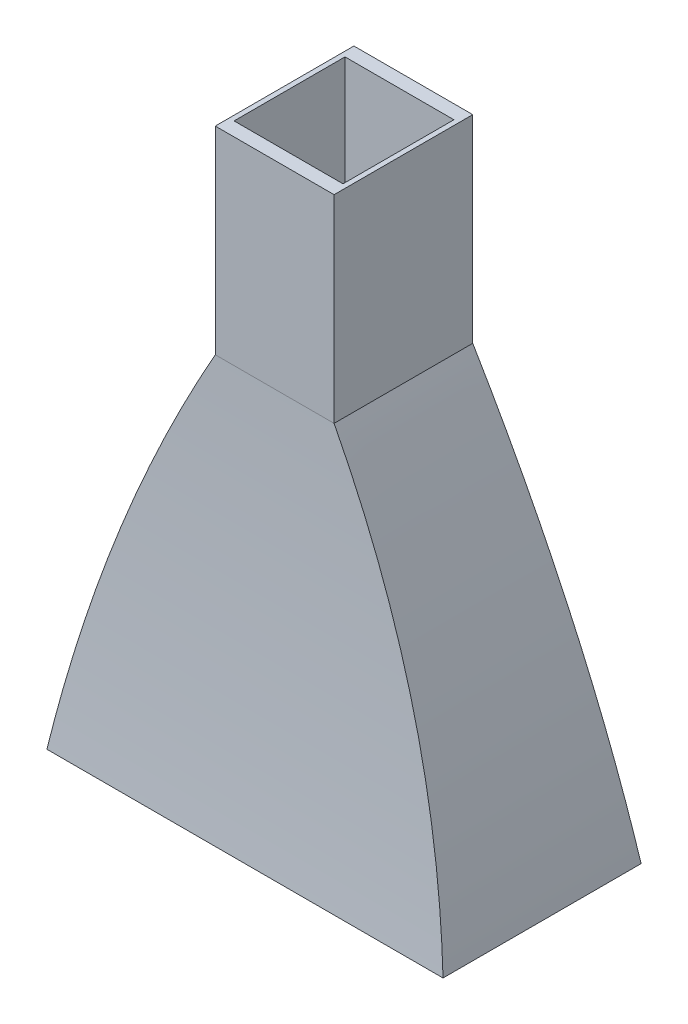
ISO-10303-21;
HEADER;
FILE_DESCRIPTION(('STEP AP214'),'2;1');
FILE_NAME('part.step','',(''),(''),'','','');
FILE_SCHEMA(('AUTOMOTIVE_DESIGN { 1 0 10303 214 1 1 1 1 }'));
ENDSEC;
DATA;
#1=APPLICATION_CONTEXT('core data for automotive mechanical design processes');
#2=APPLICATION_PROTOCOL_DEFINITION('international standard','automotive_design',2000,#1);
#3=PRODUCT_CONTEXT('',#1,'mechanical');
#4=PRODUCT('Part','Part','',(#3));
#5=PRODUCT_RELATED_PRODUCT_CATEGORY('part','',(#4));
#6=PRODUCT_DEFINITION_FORMATION('','',#4);
#7=PRODUCT_DEFINITION_CONTEXT('part definition',#1,'design');
#8=PRODUCT_DEFINITION('design','',#6,#7);
#9=PRODUCT_DEFINITION_SHAPE('','',#8);
#10=(LENGTH_UNIT() NAMED_UNIT(*) SI_UNIT(.MILLI.,.METRE.));
#11=(NAMED_UNIT(*) PLANE_ANGLE_UNIT() SI_UNIT($,.RADIAN.));
#12=(NAMED_UNIT(*) SI_UNIT($,.STERADIAN.) SOLID_ANGLE_UNIT());
#13=UNCERTAINTY_MEASURE_WITH_UNIT(LENGTH_MEASURE(1.E-05),#10,'distance_accuracy_value','');
#14=(GEOMETRIC_REPRESENTATION_CONTEXT(3) GLOBAL_UNCERTAINTY_ASSIGNED_CONTEXT((#13)) GLOBAL_UNIT_ASSIGNED_CONTEXT((#10,
#11,#12)) REPRESENTATION_CONTEXT('',''));
#15=CARTESIAN_POINT('',(0.,0.,0.));
#16=DIRECTION('',(0.,0.,1.));
#17=DIRECTION('',(1.,0.,0.));
#18=AXIS2_PLACEMENT_3D('',#15,#16,#17);
#19=CARTESIAN_POINT('',(0.,0.,0.));
#20=DIRECTION('',(0.,1.,0.));
#21=DIRECTION('',(0.,0.,1.));
#22=AXIS2_PLACEMENT_3D('',#19,#20,#21);
#23=PLANE('',#22);
#24=DIRECTION('',(-1.,0.,0.));
#25=VECTOR('',#24,1.);
#26=CARTESIAN_POINT('',(-93.6444715864191,0.,-44.4638523278584));
#27=LINE('',#26,#25);
#28=CARTESIAN_POINT('',(93.6444715864191,0.,-44.4638523278584));
#29=VERTEX_POINT('',#28);
#30=CARTESIAN_POINT('',(-93.6444715864191,0.,-44.4638523278584));
#31=VERTEX_POINT('',#30);
#32=EDGE_CURVE('E360',#29,#31,#27,.T.);
#33=ORIENTED_EDGE('',*,*,#32,.T.);
#34=DIRECTION('',(0.,0.,1.));
#35=VECTOR('',#34,1.);
#36=CARTESIAN_POINT('',(-93.6444715864191,0.,-44.4638523278584));
#37=LINE('',#36,#35);
#38=CARTESIAN_POINT('',(-93.6444715864191,0.,44.4638523278584));
#39=VERTEX_POINT('',#38);
#40=EDGE_CURVE('E400',#31,#39,#37,.T.);
#41=ORIENTED_EDGE('',*,*,#40,.T.);
#42=DIRECTION('',(1.,0.,0.));
#43=VECTOR('',#42,1.);
#44=CARTESIAN_POINT('',(-93.6444715864191,0.,44.4638523278584));
#45=LINE('',#44,#43);
#46=CARTESIAN_POINT('',(93.6444715864191,0.,44.4638523278584));
#47=VERTEX_POINT('',#46);
#48=EDGE_CURVE('E166',#39,#47,#45,.T.);
#49=ORIENTED_EDGE('',*,*,#48,.T.);
#50=DIRECTION('',(0.,0.,-1.));
#51=VECTOR('',#50,1.);
#52=CARTESIAN_POINT('',(93.6444715864191,0.,-44.4638523278584));
#53=LINE('',#52,#51);
#54=EDGE_CURVE('E394',#47,#29,#53,.T.);
#55=ORIENTED_EDGE('',*,*,#54,.T.);
#56=EDGE_LOOP('',(#33,#41,#49,#55));
#57=FACE_BOUND('',#56,.T.);
#58=DIRECTION('',(0.,0.,-1.));
#59=VECTOR('',#58,1.);
#60=CARTESIAN_POINT('',(100.,0.,-50.));
#61=LINE('',#60,#59);
#62=CARTESIAN_POINT('',(100.,0.,50.));
#63=VERTEX_POINT('',#62);
#64=CARTESIAN_POINT('',(100.,0.,-50.));
#65=VERTEX_POINT('',#64);
#66=EDGE_CURVE('E364',#63,#65,#61,.T.);
#67=ORIENTED_EDGE('',*,*,#66,.F.);
#68=DIRECTION('',(1.,0.,0.));
#69=VECTOR('',#68,1.);
#70=CARTESIAN_POINT('',(-100.,0.,50.));
#71=LINE('',#70,#69);
#72=CARTESIAN_POINT('',(-100.,0.,50.));
#73=VERTEX_POINT('',#72);
#74=EDGE_CURVE('E367',#73,#63,#71,.T.);
#75=ORIENTED_EDGE('',*,*,#74,.F.);
#76=DIRECTION('',(0.,0.,1.));
#77=VECTOR('',#76,1.);
#78=CARTESIAN_POINT('',(-100.,0.,-50.));
#79=LINE('',#78,#77);
#80=CARTESIAN_POINT('',(-100.,0.,-50.));
#81=VERTEX_POINT('',#80);
#82=EDGE_CURVE('E59',#81,#73,#79,.T.);
#83=ORIENTED_EDGE('',*,*,#82,.F.);
#84=DIRECTION('',(-1.,0.,0.));
#85=VECTOR('',#84,1.);
#86=CARTESIAN_POINT('',(-100.,0.,-50.));
#87=LINE('',#86,#85);
#88=EDGE_CURVE('E12',#65,#81,#87,.T.);
#89=ORIENTED_EDGE('',*,*,#88,.F.);
#90=EDGE_LOOP('',(#67,#75,#83,#89));
#91=FACE_BOUND('',#90,.T.);
#92=ADVANCED_FACE('F49',(#57,#91),#23,.F.);
#93=CARTESIAN_POINT('',(-30.,200.,-35.));
#94=CARTESIAN_POINT('',(-47.9907663896583,167.645429362881,-35.7599261311173));
#95=CARTESIAN_POINT('',(-77.6441030569047,101.978601572545,-39.0174514802352));
#96=CARTESIAN_POINT('',(-94.657433056325,34.3120960295476,-45.7599261311173));
#97=CARTESIAN_POINT('',(-100.,0.,-50.));
#98=CARTESIAN_POINT('',(-9.99999999999999,200.,-35.));
#99=CARTESIAN_POINT('',(-15.9969221298861,167.645429362881,-35.7599261311173));
#100=CARTESIAN_POINT('',(-25.8813676856349,101.978601572545,-39.0174514802352));
#101=CARTESIAN_POINT('',(-31.5524776854417,34.3120960295476,-45.7599261311173));
#102=CARTESIAN_POINT('',(-33.3333333333333,0.,-50.));
#103=CARTESIAN_POINT('',(10.,200.,-35.));
#104=CARTESIAN_POINT('',(15.9969221298861,167.645429362881,-35.7599261311173));
#105=CARTESIAN_POINT('',(25.8813676856349,101.978601572545,-39.0174514802352));
#106=CARTESIAN_POINT('',(31.5524776854417,34.3120960295476,-45.7599261311173));
#107=CARTESIAN_POINT('',(33.3333333333334,0.,-50.));
#108=CARTESIAN_POINT('',(30.,200.,-35.));
#109=CARTESIAN_POINT('',(47.9907663896584,167.645429362881,-35.7599261311173));
#110=CARTESIAN_POINT('',(77.6441030569047,101.978601572545,-39.0174514802352));
#111=CARTESIAN_POINT('',(94.6574330563251,34.3120960295476,-45.7599261311173));
#112=CARTESIAN_POINT('',(100.,0.,-50.));
#113=B_SPLINE_SURFACE_WITH_KNOTS('',3,3,((#93,#94,#95,#96,#97),(#98,#99,#100,#101,#102),(#103,
#104,#105,#106,#107),(#108,#109,#110,#111,#112)),.UNSPECIFIED.,.F.,.F.,.F.,(4,4),(4,1,4),(0.,
1.),(0.,0.511088272058341,1.),.UNSPECIFIED.);
#114=DIRECTION('',(-1.,0.,0.));
#115=VECTOR('',#114,1.);
#116=CARTESIAN_POINT('',(30.,200.,-35.));
#117=LINE('',#116,#115);
#118=CARTESIAN_POINT('',(30.,200.,-35.));
#119=VERTEX_POINT('',#118);
#120=CARTESIAN_POINT('',(-30.,200.,-35.));
#121=VERTEX_POINT('',#120);
#122=EDGE_CURVE('E324',#119,#121,#117,.T.);
#123=CARTESIAN_POINT('',(30.,200.,-35.));
#124=CARTESIAN_POINT('',(47.9907663896584,167.645429362881,-35.7599261311173));
#125=CARTESIAN_POINT('',(77.6441030569047,101.978601572545,-39.0174514802352));
#126=CARTESIAN_POINT('',(94.6574330563251,34.3120960295476,-45.7599261311173));
#127=CARTESIAN_POINT('',(100.,0.,-50.));
#128=B_SPLINE_CURVE_WITH_KNOTS('',3,(#123,#124,#125,#126,#127),.UNSPECIFIED.,.F.,.F.,(4,1,4),
(0.,0.511088272058341,1.),.UNSPECIFIED.);
#129=EDGE_CURVE('E581',#119,#65,#128,.T.);
#130=CARTESIAN_POINT('',(-30.,200.,-35.));
#131=CARTESIAN_POINT('',(-47.9907663896583,167.645429362881,-35.7599261311173));
#132=CARTESIAN_POINT('',(-77.6441030569047,101.978601572545,-39.0174514802352));
#133=CARTESIAN_POINT('',(-94.657433056325,34.3120960295476,-45.7599261311173));
#134=CARTESIAN_POINT('',(-100.,0.,-50.));
#135=B_SPLINE_CURVE_WITH_KNOTS('',3,(#130,#131,#132,#133,#134),.UNSPECIFIED.,.F.,.F.,(4,1,4),
(0.,0.511088272058341,1.),.UNSPECIFIED.);
#136=EDGE_CURVE('E304',#81,#121,#135,.F.);
#137=ORIENTED_EDGE('',*,*,#122,.F.);
#138=ORIENTED_EDGE('',*,*,#129,.T.);
#139=ORIENTED_EDGE('',*,*,#88,.T.);
#140=ORIENTED_EDGE('',*,*,#136,.T.);
#141=EDGE_LOOP('',(#137,#138,#139,#140));
#142=FACE_BOUND('',#141,.T.);
#143=ADVANCED_FACE('F233',(#142),#113,.T.);
#144=CARTESIAN_POINT('',(30.,200.,-35.));
#145=CARTESIAN_POINT('',(47.9907663896584,167.645429362881,-35.7599261311173));
#146=CARTESIAN_POINT('',(77.6441030569047,101.978601572545,-39.0174514802352));
#147=CARTESIAN_POINT('',(94.6574330563251,34.3120960295476,-45.7599261311173));
#148=CARTESIAN_POINT('',(100.,0.,-50.));
#149=CARTESIAN_POINT('',(30.,200.,-11.6666666666667));
#150=CARTESIAN_POINT('',(47.9907663896584,167.645429362881,-11.9199753770391));
#151=CARTESIAN_POINT('',(77.6441030569047,101.978601572545,-13.0058171600784));
#152=CARTESIAN_POINT('',(94.6574330563251,34.3120960295476,-15.2533087103724));
#153=CARTESIAN_POINT('',(100.,0.,-16.6666666666667));
#154=CARTESIAN_POINT('',(30.,200.,11.6666666666667));
#155=CARTESIAN_POINT('',(47.9907663896584,167.645429362881,11.9199753770391));
#156=CARTESIAN_POINT('',(77.6441030569047,101.978601572545,13.0058171600784));
#157=CARTESIAN_POINT('',(94.6574330563251,34.3120960295476,15.2533087103724));
#158=CARTESIAN_POINT('',(100.,0.,16.6666666666667));
#159=CARTESIAN_POINT('',(30.,200.,35.));
#160=CARTESIAN_POINT('',(47.9907663896584,167.645429362881,35.7599261311173));
#161=CARTESIAN_POINT('',(77.6441030569047,101.978601572545,39.0174514802352));
#162=CARTESIAN_POINT('',(94.657433056325,34.3120960295476,45.7599261311173));
#163=CARTESIAN_POINT('',(100.,0.,50.));
#164=B_SPLINE_SURFACE_WITH_KNOTS('',3,3,((#144,#145,#146,#147,#148),(#149,#150,#151,#152,#153),
(#154,#155,#156,#157,#158),(#159,#160,#161,#162,#163)),.UNSPECIFIED.,.F.,.F.,.F.,(4,4),(4,1,4),
(0.,1.),(0.,0.511088272058341,1.),.UNSPECIFIED.);
#165=DIRECTION('',(0.,0.,-1.));
#166=VECTOR('',#165,1.);
#167=CARTESIAN_POINT('',(30.,200.,35.));
#168=LINE('',#167,#166);
#169=CARTESIAN_POINT('',(30.,200.,35.));
#170=VERTEX_POINT('',#169);
#171=EDGE_CURVE('E305',#170,#119,#168,.T.);
#172=CARTESIAN_POINT('',(30.,200.,35.));
#173=CARTESIAN_POINT('',(47.9907663896584,167.645429362881,35.7599261311173));
#174=CARTESIAN_POINT('',(77.6441030569047,101.978601572545,39.0174514802352));
#175=CARTESIAN_POINT('',(94.657433056325,34.3120960295476,45.7599261311173));
#176=CARTESIAN_POINT('',(100.,0.,50.));
#177=B_SPLINE_CURVE_WITH_KNOTS('',3,(#172,#173,#174,#175,#176),.UNSPECIFIED.,.F.,.F.,(4,1,4),
(0.,0.511088272058341,1.),.UNSPECIFIED.);
#178=EDGE_CURVE('E512',#170,#63,#177,.T.);
#179=ORIENTED_EDGE('',*,*,#171,.F.);
#180=ORIENTED_EDGE('',*,*,#178,.T.);
#181=ORIENTED_EDGE('',*,*,#66,.T.);
#182=ORIENTED_EDGE('',*,*,#129,.F.);
#183=EDGE_LOOP('',(#179,#180,#181,#182));
#184=FACE_BOUND('',#183,.T.);
#185=ADVANCED_FACE('F355',(#184),#164,.T.);
#186=CARTESIAN_POINT('',(-30.,200.,35.));
#187=CARTESIAN_POINT('',(-47.9907663896583,167.645429362881,35.7599261311173));
#188=CARTESIAN_POINT('',(-77.6441030569047,101.978601572545,39.0174514802352));
#189=CARTESIAN_POINT('',(-94.657433056325,34.3120960295476,45.7599261311173));
#190=CARTESIAN_POINT('',(-100.,0.,50.));
#191=CARTESIAN_POINT('',(-30.,200.,11.6666666666667));
#192=CARTESIAN_POINT('',(-47.9907663896583,167.645429362881,11.9199753770391));
#193=CARTESIAN_POINT('',(-77.6441030569047,101.978601572545,13.0058171600784));
#194=CARTESIAN_POINT('',(-94.657433056325,34.3120960295476,15.2533087103724));
#195=CARTESIAN_POINT('',(-100.,0.,16.6666666666667));
#196=CARTESIAN_POINT('',(-30.,200.,-11.6666666666666));
#197=CARTESIAN_POINT('',(-47.9907663896583,167.645429362881,-11.9199753770391));
#198=CARTESIAN_POINT('',(-77.6441030569047,101.978601572545,-13.0058171600784));
#199=CARTESIAN_POINT('',(-94.657433056325,34.3120960295476,-15.2533087103724));
#200=CARTESIAN_POINT('',(-100.,0.,-16.6666666666667));
#201=CARTESIAN_POINT('',(-30.,200.,-35.));
#202=CARTESIAN_POINT('',(-47.9907663896583,167.645429362881,-35.7599261311173));
#203=CARTESIAN_POINT('',(-77.6441030569047,101.978601572545,-39.0174514802352));
#204=CARTESIAN_POINT('',(-94.657433056325,34.3120960295476,-45.7599261311173));
#205=CARTESIAN_POINT('',(-100.,0.,-50.));
#206=B_SPLINE_SURFACE_WITH_KNOTS('',3,3,((#186,#187,#188,#189,#190),(#191,#192,#193,#194,#195),
(#196,#197,#198,#199,#200),(#201,#202,#203,#204,#205)),.UNSPECIFIED.,.F.,.F.,.F.,(4,4),(4,1,4),
(0.,1.),(0.,0.511088272058341,1.),.UNSPECIFIED.);
#207=DIRECTION('',(0.,0.,1.));
#208=VECTOR('',#207,1.);
#209=CARTESIAN_POINT('',(-30.,200.,35.));
#210=LINE('',#209,#208);
#211=CARTESIAN_POINT('',(-30.,200.,35.));
#212=VERTEX_POINT('',#211);
#213=EDGE_CURVE('E320',#121,#212,#210,.T.);
#214=CARTESIAN_POINT('',(-30.,200.,35.));
#215=CARTESIAN_POINT('',(-47.9907663896583,167.645429362881,35.7599261311173));
#216=CARTESIAN_POINT('',(-77.6441030569047,101.978601572545,39.0174514802352));
#217=CARTESIAN_POINT('',(-94.657433056325,34.3120960295476,45.7599261311173));
#218=CARTESIAN_POINT('',(-100.,0.,50.));
#219=B_SPLINE_CURVE_WITH_KNOTS('',3,(#214,#215,#216,#217,#218),.UNSPECIFIED.,.F.,.F.,(4,1,4),
(0.,0.511088272058341,1.),.UNSPECIFIED.);
#220=EDGE_CURVE('E375',#212,#73,#219,.T.);
#221=ORIENTED_EDGE('',*,*,#213,.F.);
#222=ORIENTED_EDGE('',*,*,#136,.F.);
#223=ORIENTED_EDGE('',*,*,#82,.T.);
#224=ORIENTED_EDGE('',*,*,#220,.F.);
#225=EDGE_LOOP('',(#221,#222,#223,#224));
#226=FACE_BOUND('',#225,.T.);
#227=ADVANCED_FACE('F527',(#226),#206,.T.);
#228=CARTESIAN_POINT('',(30.,200.,35.));
#229=CARTESIAN_POINT('',(47.9907663896584,167.645429362881,35.7599261311173));
#230=CARTESIAN_POINT('',(77.6441030569047,101.978601572545,39.0174514802352));
#231=CARTESIAN_POINT('',(94.657433056325,34.3120960295476,45.7599261311173));
#232=CARTESIAN_POINT('',(100.,0.,50.));
#233=CARTESIAN_POINT('',(10.,200.,35.));
#234=CARTESIAN_POINT('',(15.9969221298861,167.645429362881,35.7599261311173));
#235=CARTESIAN_POINT('',(25.8813676856349,101.978601572545,39.0174514802352));
#236=CARTESIAN_POINT('',(31.5524776854417,34.3120960295476,45.7599261311173));
#237=CARTESIAN_POINT('',(33.3333333333333,0.,50.));
#238=CARTESIAN_POINT('',(-9.99999999999999,200.,35.));
#239=CARTESIAN_POINT('',(-15.9969221298861,167.645429362881,35.7599261311173));
#240=CARTESIAN_POINT('',(-25.8813676856349,101.978601572545,39.0174514802352));
#241=CARTESIAN_POINT('',(-31.5524776854417,34.3120960295476,45.7599261311173));
#242=CARTESIAN_POINT('',(-33.3333333333333,0.,50.));
#243=CARTESIAN_POINT('',(-30.,200.,35.));
#244=CARTESIAN_POINT('',(-47.9907663896583,167.645429362881,35.7599261311173));
#245=CARTESIAN_POINT('',(-77.6441030569047,101.978601572545,39.0174514802352));
#246=CARTESIAN_POINT('',(-94.657433056325,34.3120960295476,45.7599261311173));
#247=CARTESIAN_POINT('',(-100.,0.,50.));
#248=B_SPLINE_SURFACE_WITH_KNOTS('',3,3,((#228,#229,#230,#231,#232),(#233,#234,#235,#236,#237),
(#238,#239,#240,#241,#242),(#243,#244,#245,#246,#247)),.UNSPECIFIED.,.F.,.F.,.F.,(4,4),(4,1,4),
(0.,1.),(0.,0.511088272058341,1.),.UNSPECIFIED.);
#249=DIRECTION('',(1.,0.,0.));
#250=VECTOR('',#249,1.);
#251=CARTESIAN_POINT('',(30.,200.,35.));
#252=LINE('',#251,#250);
#253=EDGE_CURVE('E296',#212,#170,#252,.T.);
#254=ORIENTED_EDGE('',*,*,#253,.F.);
#255=ORIENTED_EDGE('',*,*,#220,.T.);
#256=ORIENTED_EDGE('',*,*,#74,.T.);
#257=ORIENTED_EDGE('',*,*,#178,.F.);
#258=EDGE_LOOP('',(#254,#255,#256,#257));
#259=FACE_BOUND('',#258,.T.);
#260=ADVANCED_FACE('F198',(#259),#248,.T.);
#261=CARTESIAN_POINT('',(-93.6444715864191,0.,-44.4638523278584));
#262=CARTESIAN_POINT('',(-88.7023841306296,34.2787248351622,-41.5879917665136));
#263=CARTESIAN_POINT('',(-72.7316138193124,101.913596119643,-35.9662529985332));
#264=CARTESIAN_POINT('',(-44.6060697396836,167.612058168496,-30.612090214608));
#265=CARTESIAN_POINT('',(-27.5,200.,-28.));
#266=CARTESIAN_POINT('',(-93.6444715864191,0.,-14.8212841092861));
#267=CARTESIAN_POINT('',(-88.7023841306296,34.2787248351622,-13.8626639221712));
#268=CARTESIAN_POINT('',(-72.7316138193124,101.913596119643,-11.9887509995111));
#269=CARTESIAN_POINT('',(-44.6060697396836,167.612058168496,-10.204030071536));
#270=CARTESIAN_POINT('',(-27.5,200.,-9.33333333333333));
#271=CARTESIAN_POINT('',(-93.6444715864191,0.,14.8212841092861));
#272=CARTESIAN_POINT('',(-88.7023841306296,34.2787248351622,13.8626639221712));
#273=CARTESIAN_POINT('',(-72.7316138193124,101.913596119643,11.988750999511));
#274=CARTESIAN_POINT('',(-44.6060697396836,167.612058168496,10.204030071536));
#275=CARTESIAN_POINT('',(-27.5,200.,9.33333333333334));
#276=CARTESIAN_POINT('',(-93.6444715864191,0.,44.4638523278584));
#277=CARTESIAN_POINT('',(-88.7023841306296,34.2787248351622,41.5879917665136));
#278=CARTESIAN_POINT('',(-72.7316138193124,101.913596119643,35.9662529985332));
#279=CARTESIAN_POINT('',(-44.6060697396836,167.612058168496,30.612090214608));
#280=CARTESIAN_POINT('',(-27.5,200.,28.));
#281=B_SPLINE_SURFACE_WITH_KNOTS('',3,3,((#261,#262,#263,#264,#265),(#266,#267,#268,#269,#270),
(#271,#272,#273,#274,#275),(#276,#277,#278,#279,#280)),.UNSPECIFIED.,.F.,.F.,.F.,(4,4),(4,1,4),
(0.,1.),(0.,0.4892804652425,1.),.UNSPECIFIED.);
#282=CARTESIAN_POINT('',(-93.6444715864191,0.,-44.4638523278584));
#283=CARTESIAN_POINT('',(-88.7023841306296,34.2787248351622,-41.5879917665136));
#284=CARTESIAN_POINT('',(-72.7316138193124,101.913596119643,-35.9662529985332));
#285=CARTESIAN_POINT('',(-44.6060697396836,167.612058168496,-30.612090214608));
#286=CARTESIAN_POINT('',(-27.5,200.,-28.));
#287=B_SPLINE_CURVE_WITH_KNOTS('',3,(#282,#283,#284,#285,#286),.UNSPECIFIED.,.F.,.F.,(4,1,4),
(0.,0.4892804652425,1.),.UNSPECIFIED.);
#288=CARTESIAN_POINT('',(-27.5,200.,-28.));
#289=VERTEX_POINT('',#288);
#290=EDGE_CURVE('E171',#289,#31,#287,.F.);
#291=DIRECTION('',(0.,0.,1.));
#292=VECTOR('',#291,1.);
#293=CARTESIAN_POINT('',(-27.5,200.,-28.));
#294=LINE('',#293,#292);
#295=CARTESIAN_POINT('',(-27.5,200.,28.));
#296=VERTEX_POINT('',#295);
#297=EDGE_CURVE('E53',#289,#296,#294,.T.);
#298=CARTESIAN_POINT('',(-93.6444715864191,0.,44.4638523278584));
#299=CARTESIAN_POINT('',(-88.7023841306296,34.2787248351622,41.5879917665136));
#300=CARTESIAN_POINT('',(-72.7316138193124,101.913596119643,35.9662529985332));
#301=CARTESIAN_POINT('',(-44.6060697396836,167.612058168496,30.612090214608));
#302=CARTESIAN_POINT('',(-27.5,200.,28.));
#303=B_SPLINE_CURVE_WITH_KNOTS('',3,(#298,#299,#300,#301,#302),.UNSPECIFIED.,.F.,.F.,(4,1,4),
(0.,0.4892804652425,1.),.UNSPECIFIED.);
#304=EDGE_CURVE('E163',#39,#296,#303,.T.);
#305=ORIENTED_EDGE('',*,*,#40,.F.);
#306=ORIENTED_EDGE('',*,*,#290,.F.);
#307=ORIENTED_EDGE('',*,*,#297,.T.);
#308=ORIENTED_EDGE('',*,*,#304,.F.);
#309=EDGE_LOOP('',(#305,#306,#307,#308));
#310=FACE_BOUND('',#309,.T.);
#311=ADVANCED_FACE('F175',(#310),#281,.F.);
#312=CARTESIAN_POINT('',(-93.6444715864191,0.,44.4638523278584));
#313=CARTESIAN_POINT('',(-88.7023841306296,34.2787248351622,41.5879917665136));
#314=CARTESIAN_POINT('',(-72.7316138193124,101.913596119643,35.9662529985332));
#315=CARTESIAN_POINT('',(-44.6060697396836,167.612058168496,30.612090214608));
#316=CARTESIAN_POINT('',(-27.5,200.,28.));
#317=CARTESIAN_POINT('',(-31.2148238621397,0.,44.4638523278584));
#318=CARTESIAN_POINT('',(-29.5674613768765,34.2787248351622,41.5879917665136));
#319=CARTESIAN_POINT('',(-24.2438712731041,101.913596119643,35.9662529985332));
#320=CARTESIAN_POINT('',(-14.8686899132279,167.612058168496,30.612090214608));
#321=CARTESIAN_POINT('',(-9.16666666666666,200.,28.));
#322=CARTESIAN_POINT('',(31.2148238621397,0.,44.4638523278584));
#323=CARTESIAN_POINT('',(29.5674613768765,34.2787248351622,41.5879917665136));
#324=CARTESIAN_POINT('',(24.2438712731041,101.913596119643,35.9662529985332));
#325=CARTESIAN_POINT('',(14.8686899132279,167.612058168496,30.612090214608));
#326=CARTESIAN_POINT('',(9.16666666666667,200.,28.));
#327=CARTESIAN_POINT('',(93.6444715864191,0.,44.4638523278584));
#328=CARTESIAN_POINT('',(88.7023841306296,34.2787248351622,41.5879917665136));
#329=CARTESIAN_POINT('',(72.7316138193124,101.913596119643,35.9662529985332));
#330=CARTESIAN_POINT('',(44.6060697396836,167.612058168496,30.612090214608));
#331=CARTESIAN_POINT('',(27.5,200.,28.));
#332=B_SPLINE_SURFACE_WITH_KNOTS('',3,3,((#312,#313,#314,#315,#316),(#317,#318,#319,#320,#321),
(#322,#323,#324,#325,#326),(#327,#328,#329,#330,#331)),.UNSPECIFIED.,.F.,.F.,.F.,(4,4),(4,1,4),
(0.,1.),(0.,0.4892804652425,1.),.UNSPECIFIED.);
#333=DIRECTION('',(1.,0.,0.));
#334=VECTOR('',#333,1.);
#335=CARTESIAN_POINT('',(27.5,200.,28.));
#336=LINE('',#335,#334);
#337=CARTESIAN_POINT('',(27.5,200.,28.));
#338=VERTEX_POINT('',#337);
#339=EDGE_CURVE('E155',#296,#338,#336,.T.);
#340=CARTESIAN_POINT('',(93.6444715864191,0.,44.4638523278584));
#341=CARTESIAN_POINT('',(88.7023841306296,34.2787248351622,41.5879917665136));
#342=CARTESIAN_POINT('',(72.7316138193124,101.913596119643,35.9662529985332));
#343=CARTESIAN_POINT('',(44.6060697396836,167.612058168496,30.612090214608));
#344=CARTESIAN_POINT('',(27.5,200.,28.));
#345=B_SPLINE_CURVE_WITH_KNOTS('',3,(#340,#341,#342,#343,#344),.UNSPECIFIED.,.F.,.F.,(4,1,4),
(0.,0.4892804652425,1.),.UNSPECIFIED.);
#346=EDGE_CURVE('E170',#47,#338,#345,.T.);
#347=ORIENTED_EDGE('',*,*,#48,.F.);
#348=ORIENTED_EDGE('',*,*,#304,.T.);
#349=ORIENTED_EDGE('',*,*,#339,.T.);
#350=ORIENTED_EDGE('',*,*,#346,.F.);
#351=EDGE_LOOP('',(#347,#348,#349,#350));
#352=FACE_BOUND('',#351,.T.);
#353=ADVANCED_FACE('F164',(#352),#332,.F.);
#354=CARTESIAN_POINT('',(93.6444715864191,0.,-44.4638523278584));
#355=CARTESIAN_POINT('',(88.7023841306296,34.2787248351622,-41.5879917665136));
#356=CARTESIAN_POINT('',(72.7316138193124,101.913596119643,-35.9662529985332));
#357=CARTESIAN_POINT('',(44.6060697396836,167.612058168496,-30.612090214608));
#358=CARTESIAN_POINT('',(27.5,200.,-28.));
#359=CARTESIAN_POINT('',(31.2148238621397,0.,-44.4638523278584));
#360=CARTESIAN_POINT('',(29.5674613768765,34.2787248351622,-41.5879917665136));
#361=CARTESIAN_POINT('',(24.2438712731041,101.913596119643,-35.9662529985332));
#362=CARTESIAN_POINT('',(14.8686899132279,167.612058168496,-30.612090214608));
#363=CARTESIAN_POINT('',(9.16666666666666,200.,-28.));
#364=CARTESIAN_POINT('',(-31.2148238621397,0.,-44.4638523278584));
#365=CARTESIAN_POINT('',(-29.5674613768765,34.2787248351622,-41.5879917665136));
#366=CARTESIAN_POINT('',(-24.2438712731041,101.913596119643,-35.9662529985332));
#367=CARTESIAN_POINT('',(-14.8686899132279,167.612058168496,-30.612090214608));
#368=CARTESIAN_POINT('',(-9.16666666666667,200.,-28.));
#369=CARTESIAN_POINT('',(-93.6444715864191,0.,-44.4638523278584));
#370=CARTESIAN_POINT('',(-88.7023841306296,34.2787248351622,-41.5879917665136));
#371=CARTESIAN_POINT('',(-72.7316138193124,101.913596119643,-35.9662529985332));
#372=CARTESIAN_POINT('',(-44.6060697396836,167.612058168496,-30.612090214608));
#373=CARTESIAN_POINT('',(-27.5,200.,-28.));
#374=B_SPLINE_SURFACE_WITH_KNOTS('',3,3,((#354,#355,#356,#357,#358),(#359,#360,#361,#362,#363),
(#364,#365,#366,#367,#368),(#369,#370,#371,#372,#373)),.UNSPECIFIED.,.F.,.F.,.F.,(4,4),(4,1,4),
(0.,1.),(0.,0.4892804652425,1.),.UNSPECIFIED.);
#375=CARTESIAN_POINT('',(93.6444715864191,0.,-44.4638523278584));
#376=CARTESIAN_POINT('',(88.7023841306296,34.2787248351622,-41.5879917665136));
#377=CARTESIAN_POINT('',(72.7316138193124,101.913596119643,-35.9662529985332));
#378=CARTESIAN_POINT('',(44.6060697396836,167.612058168496,-30.612090214608));
#379=CARTESIAN_POINT('',(27.5,200.,-28.));
#380=B_SPLINE_CURVE_WITH_KNOTS('',3,(#375,#376,#377,#378,#379),.UNSPECIFIED.,.F.,.F.,(4,1,4),
(0.,0.4892804652425,1.),.UNSPECIFIED.);
#381=CARTESIAN_POINT('',(27.5,200.,-28.));
#382=VERTEX_POINT('',#381);
#383=EDGE_CURVE('E75',#29,#382,#380,.T.);
#384=DIRECTION('',(-1.,0.,0.));
#385=VECTOR('',#384,1.);
#386=CARTESIAN_POINT('',(27.5,200.,-28.));
#387=LINE('',#386,#385);
#388=EDGE_CURVE('E256',#382,#289,#387,.T.);
#389=ORIENTED_EDGE('',*,*,#32,.F.);
#390=ORIENTED_EDGE('',*,*,#383,.T.);
#391=ORIENTED_EDGE('',*,*,#388,.T.);
#392=ORIENTED_EDGE('',*,*,#290,.T.);
#393=EDGE_LOOP('',(#389,#390,#391,#392));
#394=FACE_BOUND('',#393,.T.);
#395=ADVANCED_FACE('F211',(#394),#374,.F.);
#396=CARTESIAN_POINT('',(93.6444715864191,0.,44.4638523278584));
#397=CARTESIAN_POINT('',(88.7023841306296,34.2787248351622,41.5879917665136));
#398=CARTESIAN_POINT('',(72.7316138193124,101.913596119643,35.9662529985332));
#399=CARTESIAN_POINT('',(44.6060697396836,167.612058168496,30.612090214608));
#400=CARTESIAN_POINT('',(27.5,200.,28.));
#401=CARTESIAN_POINT('',(93.6444715864191,0.,14.8212841092861));
#402=CARTESIAN_POINT('',(88.7023841306296,34.2787248351622,13.8626639221712));
#403=CARTESIAN_POINT('',(72.7316138193124,101.913596119643,11.988750999511));
#404=CARTESIAN_POINT('',(44.6060697396836,167.612058168496,10.204030071536));
#405=CARTESIAN_POINT('',(27.5,200.,9.33333333333333));
#406=CARTESIAN_POINT('',(93.6444715864191,0.,-14.8212841092861));
#407=CARTESIAN_POINT('',(88.7023841306296,34.2787248351622,-13.8626639221712));
#408=CARTESIAN_POINT('',(72.7316138193124,101.913596119643,-11.988750999511));
#409=CARTESIAN_POINT('',(44.6060697396836,167.612058168496,-10.204030071536));
#410=CARTESIAN_POINT('',(27.5,200.,-9.33333333333333));
#411=CARTESIAN_POINT('',(93.6444715864191,0.,-44.4638523278584));
#412=CARTESIAN_POINT('',(88.7023841306296,34.2787248351622,-41.5879917665136));
#413=CARTESIAN_POINT('',(72.7316138193124,101.913596119643,-35.9662529985332));
#414=CARTESIAN_POINT('',(44.6060697396836,167.612058168496,-30.612090214608));
#415=CARTESIAN_POINT('',(27.5,200.,-28.));
#416=B_SPLINE_SURFACE_WITH_KNOTS('',3,3,((#396,#397,#398,#399,#400),(#401,#402,#403,#404,#405),
(#406,#407,#408,#409,#410),(#411,#412,#413,#414,#415)),.UNSPECIFIED.,.F.,.F.,.F.,(4,4),(4,1,4),
(0.,1.),(0.,0.4892804652425,1.),.UNSPECIFIED.);
#417=DIRECTION('',(0.,0.,-1.));
#418=VECTOR('',#417,1.);
#419=CARTESIAN_POINT('',(27.5,200.,-28.));
#420=LINE('',#419,#418);
#421=EDGE_CURVE('E160',#338,#382,#420,.T.);
#422=ORIENTED_EDGE('',*,*,#54,.F.);
#423=ORIENTED_EDGE('',*,*,#346,.T.);
#424=ORIENTED_EDGE('',*,*,#421,.T.);
#425=ORIENTED_EDGE('',*,*,#383,.F.);
#426=EDGE_LOOP('',(#422,#423,#424,#425));
#427=FACE_BOUND('',#426,.T.);
#428=ADVANCED_FACE('F221',(#427),#416,.F.);
#429=CARTESIAN_POINT('',(30.,300.,-35.));
#430=DIRECTION('',(-1.,0.,0.));
#431=DIRECTION('',(0.,0.,1.));
#432=AXIS2_PLACEMENT_3D('',#429,#430,#431);
#433=PLANE('',#432);
#434=ORIENTED_EDGE('',*,*,#171,.T.);
#435=DIRECTION('',(0.,-1.,0.));
#436=VECTOR('',#435,1.);
#437=CARTESIAN_POINT('',(30.,300.,-35.));
#438=LINE('',#437,#436);
#439=CARTESIAN_POINT('',(30.,300.,-35.));
#440=VERTEX_POINT('',#439);
#441=EDGE_CURVE('E396',#440,#119,#438,.T.);
#442=ORIENTED_EDGE('',*,*,#441,.F.);
#443=DIRECTION('',(0.,0.,-1.));
#444=VECTOR('',#443,1.);
#445=CARTESIAN_POINT('',(30.,300.,-35.));
#446=LINE('',#445,#444);
#447=CARTESIAN_POINT('',(30.,300.,35.));
#448=VERTEX_POINT('',#447);
#449=EDGE_CURVE('E497',#448,#440,#446,.T.);
#450=ORIENTED_EDGE('',*,*,#449,.F.);
#451=DIRECTION('',(0.,-1.,0.));
#452=VECTOR('',#451,1.);
#453=CARTESIAN_POINT('',(30.,300.,35.));
#454=LINE('',#453,#452);
#455=EDGE_CURVE('E445',#448,#170,#454,.T.);
#456=ORIENTED_EDGE('',*,*,#455,.T.);
#457=EDGE_LOOP('',(#434,#442,#450,#456));
#458=FACE_BOUND('',#457,.T.);
#459=ADVANCED_FACE('F199',(#458),#433,.F.);
#460=CARTESIAN_POINT('',(-30.,300.,-35.));
#461=DIRECTION('',(0.,0.,1.));
#462=DIRECTION('',(1.,0.,0.));
#463=AXIS2_PLACEMENT_3D('',#460,#461,#462);
#464=PLANE('',#463);
#465=ORIENTED_EDGE('',*,*,#122,.T.);
#466=DIRECTION('',(0.,-1.,0.));
#467=VECTOR('',#466,1.);
#468=CARTESIAN_POINT('',(-30.,300.,-35.));
#469=LINE('',#468,#467);
#470=CARTESIAN_POINT('',(-30.,300.,-35.));
#471=VERTEX_POINT('',#470);
#472=EDGE_CURVE('E409',#471,#121,#469,.T.);
#473=ORIENTED_EDGE('',*,*,#472,.F.);
#474=DIRECTION('',(-1.,0.,0.));
#475=VECTOR('',#474,1.);
#476=CARTESIAN_POINT('',(-30.,300.,-35.));
#477=LINE('',#476,#475);
#478=EDGE_CURVE('E468',#440,#471,#477,.T.);
#479=ORIENTED_EDGE('',*,*,#478,.F.);
#480=ORIENTED_EDGE('',*,*,#441,.T.);
#481=EDGE_LOOP('',(#465,#473,#479,#480));
#482=FACE_BOUND('',#481,.T.);
#483=ADVANCED_FACE('F423',(#482),#464,.F.);
#484=CARTESIAN_POINT('',(-30.,300.,-35.));
#485=DIRECTION('',(1.,0.,0.));
#486=DIRECTION('',(0.,0.,-1.));
#487=AXIS2_PLACEMENT_3D('',#484,#485,#486);
#488=PLANE('',#487);
#489=ORIENTED_EDGE('',*,*,#213,.T.);
#490=DIRECTION('',(0.,-1.,0.));
#491=VECTOR('',#490,1.);
#492=CARTESIAN_POINT('',(-30.,300.,35.));
#493=LINE('',#492,#491);
#494=CARTESIAN_POINT('',(-30.,300.,35.));
#495=VERTEX_POINT('',#494);
#496=EDGE_CURVE('E306',#495,#212,#493,.T.);
#497=ORIENTED_EDGE('',*,*,#496,.F.);
#498=DIRECTION('',(0.,0.,1.));
#499=VECTOR('',#498,1.);
#500=CARTESIAN_POINT('',(-30.,300.,-35.));
#501=LINE('',#500,#499);
#502=EDGE_CURVE('E463',#471,#495,#501,.T.);
#503=ORIENTED_EDGE('',*,*,#502,.F.);
#504=ORIENTED_EDGE('',*,*,#472,.T.);
#505=EDGE_LOOP('',(#489,#497,#503,#504));
#506=FACE_BOUND('',#505,.T.);
#507=ADVANCED_FACE('F286',(#506),#488,.F.);
#508=CARTESIAN_POINT('',(-30.,300.,35.));
#509=DIRECTION('',(0.,0.,-1.));
#510=DIRECTION('',(-1.,0.,0.));
#511=AXIS2_PLACEMENT_3D('',#508,#509,#510);
#512=PLANE('',#511);
#513=ORIENTED_EDGE('',*,*,#253,.T.);
#514=ORIENTED_EDGE('',*,*,#455,.F.);
#515=DIRECTION('',(1.,0.,0.));
#516=VECTOR('',#515,1.);
#517=CARTESIAN_POINT('',(-30.,300.,35.));
#518=LINE('',#517,#516);
#519=EDGE_CURVE('E460',#495,#448,#518,.T.);
#520=ORIENTED_EDGE('',*,*,#519,.F.);
#521=ORIENTED_EDGE('',*,*,#496,.T.);
#522=EDGE_LOOP('',(#513,#514,#520,#521));
#523=FACE_BOUND('',#522,.T.);
#524=ADVANCED_FACE('F281',(#523),#512,.F.);
#525=CARTESIAN_POINT('',(0.,300.,0.));
#526=DIRECTION('',(0.,1.,0.));
#527=DIRECTION('',(0.,0.,1.));
#528=AXIS2_PLACEMENT_3D('',#525,#526,#527);
#529=PLANE('',#528);
#530=DIRECTION('',(0.,0.,1.));
#531=VECTOR('',#530,1.);
#532=CARTESIAN_POINT('',(-27.5,300.,-28.));
#533=LINE('',#532,#531);
#534=CARTESIAN_POINT('',(-27.5,300.,-28.));
#535=VERTEX_POINT('',#534);
#536=CARTESIAN_POINT('',(-27.5,300.,28.));
#537=VERTEX_POINT('',#536);
#538=EDGE_CURVE('E67',#535,#537,#533,.T.);
#539=ORIENTED_EDGE('',*,*,#538,.F.);
#540=DIRECTION('',(1.,0.,0.));
#541=VECTOR('',#540,1.);
#542=CARTESIAN_POINT('',(-27.5,300.,-28.));
#543=LINE('',#542,#541);
#544=CARTESIAN_POINT('',(27.5,300.,-28.));
#545=VERTEX_POINT('',#544);
#546=EDGE_CURVE('E151',#535,#545,#543,.T.);
#547=ORIENTED_EDGE('',*,*,#546,.T.);
#548=DIRECTION('',(0.,0.,1.));
#549=VECTOR('',#548,1.);
#550=CARTESIAN_POINT('',(27.5,300.,-28.));
#551=LINE('',#550,#549);
#552=CARTESIAN_POINT('',(27.5,300.,28.));
#553=VERTEX_POINT('',#552);
#554=EDGE_CURVE('E501',#545,#553,#551,.T.);
#555=ORIENTED_EDGE('',*,*,#554,.T.);
#556=DIRECTION('',(1.,0.,0.));
#557=VECTOR('',#556,1.);
#558=CARTESIAN_POINT('',(-27.5,300.,28.));
#559=LINE('',#558,#557);
#560=EDGE_CURVE('E504',#537,#553,#559,.T.);
#561=ORIENTED_EDGE('',*,*,#560,.F.);
#562=EDGE_LOOP('',(#539,#547,#555,#561));
#563=FACE_BOUND('',#562,.T.);
#564=ORIENTED_EDGE('',*,*,#449,.T.);
#565=ORIENTED_EDGE('',*,*,#478,.T.);
#566=ORIENTED_EDGE('',*,*,#502,.T.);
#567=ORIENTED_EDGE('',*,*,#519,.T.);
#568=EDGE_LOOP('',(#564,#565,#566,#567));
#569=FACE_BOUND('',#568,.T.);
#570=ADVANCED_FACE('F277',(#563,#569),#529,.T.);
#571=CARTESIAN_POINT('',(-27.5,200.,-28.));
#572=DIRECTION('',(-1.,0.,0.));
#573=DIRECTION('',(0.,0.,1.));
#574=AXIS2_PLACEMENT_3D('',#571,#572,#573);
#575=PLANE('',#574);
#576=ORIENTED_EDGE('',*,*,#538,.T.);
#577=DIRECTION('',(0.,1.,0.));
#578=VECTOR('',#577,1.);
#579=CARTESIAN_POINT('',(-27.5,200.,28.));
#580=LINE('',#579,#578);
#581=EDGE_CURVE('E141',#296,#537,#580,.T.);
#582=ORIENTED_EDGE('',*,*,#581,.F.);
#583=ORIENTED_EDGE('',*,*,#297,.F.);
#584=DIRECTION('',(0.,1.,0.));
#585=VECTOR('',#584,1.);
#586=CARTESIAN_POINT('',(-27.5,200.,-28.));
#587=LINE('',#586,#585);
#588=EDGE_CURVE('E266',#289,#535,#587,.T.);
#589=ORIENTED_EDGE('',*,*,#588,.T.);
#590=EDGE_LOOP('',(#576,#582,#583,#589));
#591=FACE_BOUND('',#590,.T.);
#592=ADVANCED_FACE('F143',(#591),#575,.F.);
#593=CARTESIAN_POINT('',(-27.5,200.,-28.));
#594=DIRECTION('',(0.,0.,1.));
#595=DIRECTION('',(1.,0.,0.));
#596=AXIS2_PLACEMENT_3D('',#593,#594,#595);
#597=PLANE('',#596);
#598=ORIENTED_EDGE('',*,*,#546,.F.);
#599=ORIENTED_EDGE('',*,*,#588,.F.);
#600=ORIENTED_EDGE('',*,*,#388,.F.);
#601=DIRECTION('',(0.,1.,0.));
#602=VECTOR('',#601,1.);
#603=CARTESIAN_POINT('',(27.5,200.,-28.));
#604=LINE('',#603,#602);
#605=EDGE_CURVE('E328',#382,#545,#604,.T.);
#606=ORIENTED_EDGE('',*,*,#605,.T.);
#607=EDGE_LOOP('',(#598,#599,#600,#606));
#608=FACE_BOUND('',#607,.T.);
#609=ADVANCED_FACE('F276',(#608),#597,.T.);
#610=CARTESIAN_POINT('',(27.5,200.,-28.));
#611=DIRECTION('',(-1.,0.,0.));
#612=DIRECTION('',(0.,0.,1.));
#613=AXIS2_PLACEMENT_3D('',#610,#611,#612);
#614=PLANE('',#613);
#615=ORIENTED_EDGE('',*,*,#554,.F.);
#616=ORIENTED_EDGE('',*,*,#605,.F.);
#617=ORIENTED_EDGE('',*,*,#421,.F.);
#618=DIRECTION('',(0.,1.,0.));
#619=VECTOR('',#618,1.);
#620=CARTESIAN_POINT('',(27.5,200.,28.));
#621=LINE('',#620,#619);
#622=EDGE_CURVE('E150',#338,#553,#621,.T.);
#623=ORIENTED_EDGE('',*,*,#622,.T.);
#624=EDGE_LOOP('',(#615,#616,#617,#623));
#625=FACE_BOUND('',#624,.T.);
#626=ADVANCED_FACE('F336',(#625),#614,.T.);
#627=CARTESIAN_POINT('',(-27.5,200.,28.));
#628=DIRECTION('',(0.,0.,1.));
#629=DIRECTION('',(1.,0.,0.));
#630=AXIS2_PLACEMENT_3D('',#627,#628,#629);
#631=PLANE('',#630);
#632=ORIENTED_EDGE('',*,*,#560,.T.);
#633=ORIENTED_EDGE('',*,*,#622,.F.);
#634=ORIENTED_EDGE('',*,*,#339,.F.);
#635=ORIENTED_EDGE('',*,*,#581,.T.);
#636=EDGE_LOOP('',(#632,#633,#634,#635));
#637=FACE_BOUND('',#636,.T.);
#638=ADVANCED_FACE('F157',(#637),#631,.F.);
#639=CLOSED_SHELL('',(#92,#143,#185,#227,#260,#311,#353,#395,#428,#459,#483,#507,#524,#570,#592,
#609,#626,#638));
#640=MANIFOLD_SOLID_BREP('B2',#639);
#641=ADVANCED_BREP_SHAPE_REPRESENTATION('',(#18,#640),#14);
#642=SHAPE_DEFINITION_REPRESENTATION(#9,#641);
ENDSEC;
END-ISO-10303-21;
